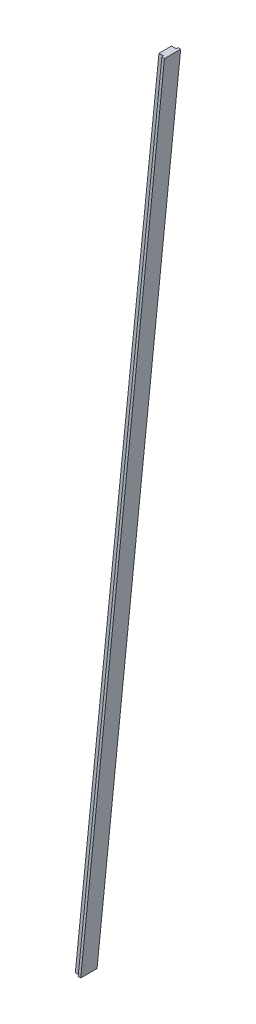
ISO-10303-21;
HEADER;
FILE_DESCRIPTION(('STEP AP214'),'2;1');
FILE_NAME('part.step','',(''),(''),'','','');
FILE_SCHEMA(('AUTOMOTIVE_DESIGN { 1 0 10303 214 1 1 1 1 }'));
ENDSEC;
DATA;
#1=APPLICATION_CONTEXT('core data for automotive mechanical design processes');
#2=APPLICATION_PROTOCOL_DEFINITION('international standard','automotive_design',2000,#1);
#3=PRODUCT_CONTEXT('',#1,'mechanical');
#4=PRODUCT('Part','Part','',(#3));
#5=PRODUCT_RELATED_PRODUCT_CATEGORY('part','',(#4));
#6=PRODUCT_DEFINITION_FORMATION('','',#4);
#7=PRODUCT_DEFINITION_CONTEXT('part definition',#1,'design');
#8=PRODUCT_DEFINITION('design','',#6,#7);
#9=PRODUCT_DEFINITION_SHAPE('','',#8);
#10=(LENGTH_UNIT() NAMED_UNIT(*) SI_UNIT(.MILLI.,.METRE.));
#11=(NAMED_UNIT(*) PLANE_ANGLE_UNIT() SI_UNIT($,.RADIAN.));
#12=(NAMED_UNIT(*) SI_UNIT($,.STERADIAN.) SOLID_ANGLE_UNIT());
#13=UNCERTAINTY_MEASURE_WITH_UNIT(LENGTH_MEASURE(1.E-05),#10,'distance_accuracy_value','');
#14=(GEOMETRIC_REPRESENTATION_CONTEXT(3) GLOBAL_UNCERTAINTY_ASSIGNED_CONTEXT((#13)) GLOBAL_UNIT_ASSIGNED_CONTEXT((#10,
#11,#12)) REPRESENTATION_CONTEXT('',''));
#15=CARTESIAN_POINT('',(0.,0.,0.));
#16=DIRECTION('',(0.,0.,1.));
#17=DIRECTION('',(1.,0.,0.));
#18=AXIS2_PLACEMENT_3D('',#15,#16,#17);
#19=CARTESIAN_POINT('',(101.565446023058,7.37466516204734,6.70567377190478));
#20=DIRECTION('',(-0.995055569961227,0.0993197497436294,0.));
#21=DIRECTION('',(0.,0.,-1.));
#22=AXIS2_PLACEMENT_3D('',#19,#20,#21);
#23=PLANE('',#22);
#24=DIRECTION('',(0.,0.,-1.));
#25=VECTOR('',#24,1.);
#26=CARTESIAN_POINT('',(100.923161092626,0.939799999999314,5.8928));
#27=LINE('',#26,#25);
#28=CARTESIAN_POINT('',(100.923161092622,0.939799999999659,5.5372));
#29=VERTEX_POINT('',#28);
#30=CARTESIAN_POINT('',(100.923161092622,0.93979999999966,6.2484));
#31=VERTEX_POINT('',#30);
#32=EDGE_CURVE('E124',#29,#31,#27,.F.);
#33=ORIENTED_EDGE('',*,*,#32,.F.);
#34=DIRECTION('',(0.0993197497436666,0.995055569961224,0.));
#35=VECTOR('',#34,1.);
#36=CARTESIAN_POINT('',(84.8570988929265,-160.021385669588,5.5372));
#37=LINE('',#36,#35);
#38=CARTESIAN_POINT('',(68.8089145710214,-320.803458102494,5.5372));
#39=VERTEX_POINT('',#38);
#40=EDGE_CURVE('E122',#29,#39,#37,.F.);
#41=ORIENTED_EDGE('',*,*,#40,.T.);
#42=DIRECTION('',(0.,0.,1.));
#43=VECTOR('',#42,1.);
#44=CARTESIAN_POINT('',(68.8089145710244,-320.803458102494,3.12420000000025));
#45=LINE('',#44,#43);
#46=CARTESIAN_POINT('',(68.8089145710244,-320.803458102494,6.2484));
#47=VERTEX_POINT('',#46);
#48=EDGE_CURVE('E75',#39,#47,#45,.T.);
#49=ORIENTED_EDGE('',*,*,#48,.T.);
#50=DIRECTION('',(-0.0993197497436633,-0.995055569961224,0.));
#51=VECTOR('',#50,1.);
#52=CARTESIAN_POINT('',(84.8709479532016,-159.882635979115,6.2484));
#53=LINE('',#52,#51);
#54=EDGE_CURVE('E74',#47,#31,#53,.F.);
#55=ORIENTED_EDGE('',*,*,#54,.T.);
#56=EDGE_LOOP('',(#33,#41,#49,#55));
#57=FACE_BOUND('',#56,.T.);
#58=ADVANCED_FACE('F17',(#57),#23,.T.);
#59=CARTESIAN_POINT('',(102.020816394357,7.3328311101911,5.5372));
#60=DIRECTION('',(0.,0.,1.));
#61=DIRECTION('',(-0.995055569961194,0.0993197497439631,0.));
#62=AXIS2_PLACEMENT_3D('',#59,#60,#61);
#63=PLANE('',#62);
#64=DIRECTION('',(-1.,0.,0.));
#65=VECTOR('',#64,1.);
#66=CARTESIAN_POINT('',(100.514741691463,0.9398,5.5372));
#67=LINE('',#66,#65);
#68=CARTESIAN_POINT('',(99.1108000000017,0.93979999999983,5.5372));
#69=VERTEX_POINT('',#68);
#70=EDGE_CURVE('E132',#29,#69,#67,.T.);
#71=ORIENTED_EDGE('',*,*,#70,.T.);
#72=DIRECTION('',(0.0993197497436294,0.995055569961227,0.));
#73=VECTOR('',#72,1.);
#74=CARTESIAN_POINT('',(83.0536767392028,-159.93182905122,5.5372));
#75=LINE('',#74,#73);
#76=CARTESIAN_POINT('',(66.9965534783867,-320.803458102495,5.5372));
#77=VERTEX_POINT('',#76);
#78=EDGE_CURVE('E115',#69,#77,#75,.F.);
#79=ORIENTED_EDGE('',*,*,#78,.T.);
#80=DIRECTION('',(1.,0.,0.));
#81=VECTOR('',#80,1.);
#82=CARTESIAN_POINT('',(68.4004951698689,-320.803458102494,5.5372));
#83=LINE('',#82,#81);
#84=EDGE_CURVE('E82',#77,#39,#83,.T.);
#85=ORIENTED_EDGE('',*,*,#84,.T.);
#86=ORIENTED_EDGE('',*,*,#40,.F.);
#87=EDGE_LOOP('',(#71,#79,#85,#86));
#88=FACE_BOUND('',#87,.T.);
#89=ADVANCED_FACE('F155',(#88),#63,.T.);
#90=CARTESIAN_POINT('',(99.753084930439,7.37466516204734,5.99447377190478));
#91=DIRECTION('',(-0.995055569961227,0.0993197497436295,0.));
#92=DIRECTION('',(0.,0.,-1.));
#93=AXIS2_PLACEMENT_3D('',#90,#91,#92);
#94=PLANE('',#93);
#95=DIRECTION('',(0.,0.,-1.));
#96=VECTOR('',#95,1.);
#97=CARTESIAN_POINT('',(99.1108,0.9398,3.12420000000025));
#98=LINE('',#97,#96);
#99=CARTESIAN_POINT('',(99.1108000000035,0.939799999999651,0.7112));
#100=VERTEX_POINT('',#99);
#101=EDGE_CURVE('E137',#69,#100,#98,.T.);
#102=ORIENTED_EDGE('',*,*,#101,.T.);
#103=DIRECTION('',(0.0993197497437047,0.99505556996122,0.));
#104=VECTOR('',#103,1.);
#105=CARTESIAN_POINT('',(83.0626156780673,-159.842272432836,0.7112));
#106=LINE('',#105,#104);
#107=CARTESIAN_POINT('',(66.9965534783834,-320.803458102494,0.7112));
#108=VERTEX_POINT('',#107);
#109=EDGE_CURVE('E112',#100,#108,#106,.F.);
#110=ORIENTED_EDGE('',*,*,#109,.T.);
#111=DIRECTION('',(0.,0.,1.));
#112=VECTOR('',#111,1.);
#113=CARTESIAN_POINT('',(66.9965534783802,-320.803458102494,3.12420000000025));
#114=LINE('',#113,#112);
#115=EDGE_CURVE('E142',#108,#77,#114,.T.);
#116=ORIENTED_EDGE('',*,*,#115,.T.);
#117=ORIENTED_EDGE('',*,*,#78,.F.);
#118=EDGE_LOOP('',(#102,#110,#116,#117));
#119=FACE_BOUND('',#118,.T.);
#120=ADVANCED_FACE('F162',(#119),#94,.T.);
#121=CARTESIAN_POINT('',(99.316307552027,7.60277698005952,0.7112));
#122=DIRECTION('',(0.,0.,-1.));
#123=DIRECTION('',(0.995055569961194,-0.0993197497439631,0.));
#124=AXIS2_PLACEMENT_3D('',#121,#122,#123);
#125=PLANE('',#124);
#126=DIRECTION('',(1.,0.,0.));
#127=VECTOR('',#126,1.);
#128=CARTESIAN_POINT('',(100.514741691463,0.9398,0.7112));
#129=LINE('',#128,#127);
#130=CARTESIAN_POINT('',(100.923161092621,0.939799999999828,0.7112));
#131=VERTEX_POINT('',#130);
#132=EDGE_CURVE('E87',#100,#131,#129,.T.);
#133=ORIENTED_EDGE('',*,*,#132,.T.);
#134=DIRECTION('',(0.0993197497436294,0.995055569961227,0.));
#135=VECTOR('',#134,1.);
#136=CARTESIAN_POINT('',(84.8660378318216,-159.93182905122,0.7112));
#137=LINE('',#136,#135);
#138=CARTESIAN_POINT('',(68.8089145710183,-320.803458102493,0.7112));
#139=VERTEX_POINT('',#138);
#140=EDGE_CURVE('E95',#131,#139,#137,.F.);
#141=ORIENTED_EDGE('',*,*,#140,.T.);
#142=DIRECTION('',(-1.,0.,0.));
#143=VECTOR('',#142,1.);
#144=CARTESIAN_POINT('',(68.4004951698689,-320.803458102494,0.7112));
#145=LINE('',#144,#143);
#146=EDGE_CURVE('E94',#139,#108,#145,.T.);
#147=ORIENTED_EDGE('',*,*,#146,.T.);
#148=ORIENTED_EDGE('',*,*,#109,.F.);
#149=EDGE_LOOP('',(#133,#141,#147,#148));
#150=FACE_BOUND('',#149,.T.);
#151=ADVANCED_FACE('F151',(#150),#125,.T.);
#152=CARTESIAN_POINT('',(101.565446023058,7.37466516204734,1.16847377190427));
#153=DIRECTION('',(-0.995055569961227,0.0993197497436294,0.));
#154=DIRECTION('',(0.,0.,-1.));
#155=AXIS2_PLACEMENT_3D('',#152,#153,#154);
#156=PLANE('',#155);
#157=DIRECTION('',(0.,0.,-1.));
#158=VECTOR('',#157,1.);
#159=CARTESIAN_POINT('',(100.923161092619,0.9398,3.12420000000025));
#160=LINE('',#159,#158);
#161=CARTESIAN_POINT('',(100.923161092619,0.939799999999991,0.));
#162=VERTEX_POINT('',#161);
#163=EDGE_CURVE('E85',#131,#162,#160,.T.);
#164=ORIENTED_EDGE('',*,*,#163,.T.);
#165=DIRECTION('',(0.0993197497436632,0.995055569961224,0.));
#166=VECTOR('',#165,1.);
#167=CARTESIAN_POINT('',(84.8709479531716,-159.882635979112,0.));
#168=LINE('',#167,#166);
#169=CARTESIAN_POINT('',(68.8089145710092,-320.803458102494,0.));
#170=VERTEX_POINT('',#169);
#171=EDGE_CURVE('E68',#162,#170,#168,.F.);
#172=ORIENTED_EDGE('',*,*,#171,.T.);
#173=DIRECTION('',(0.,0.,1.));
#174=VECTOR('',#173,1.);
#175=CARTESIAN_POINT('',(68.8089145710244,-320.803458102494,3.12420000000025));
#176=LINE('',#175,#174);
#177=EDGE_CURVE('E91',#170,#139,#176,.T.);
#178=ORIENTED_EDGE('',*,*,#177,.T.);
#179=ORIENTED_EDGE('',*,*,#140,.F.);
#180=EDGE_LOOP('',(#164,#172,#178,#179));
#181=FACE_BOUND('',#180,.T.);
#182=ADVANCED_FACE('F103',(#181),#156,.T.);
#183=CARTESIAN_POINT('',(66.5392797064932,-320.803458102494,6.70567377190478));
#184=DIRECTION('',(0.,1.,0.));
#185=DIRECTION('',(1.,0.,0.));
#186=AXIS2_PLACEMENT_3D('',#183,#184,#185);
#187=PLANE('',#186);
#188=DIRECTION('',(0.,0.,-1.));
#189=VECTOR('',#188,1.);
#190=CARTESIAN_POINT('',(69.80443686132,-320.803458102493,3.12420000000025));
#191=LINE('',#190,#189);
#192=CARTESIAN_POINT('',(69.80443686132,-320.803458102493,0.));
#193=VERTEX_POINT('',#192);
#194=CARTESIAN_POINT('',(69.80443686132,-320.803458102493,6.2484));
#195=VERTEX_POINT('',#194);
#196=EDGE_CURVE('E57',#193,#195,#191,.F.);
#197=ORIENTED_EDGE('',*,*,#196,.T.);
#198=DIRECTION('',(1.,0.,0.));
#199=VECTOR('',#198,1.);
#200=CARTESIAN_POINT('',(66.5392797064932,-320.803458102494,6.2484));
#201=LINE('',#200,#199);
#202=EDGE_CURVE('E21',#195,#47,#201,.F.);
#203=ORIENTED_EDGE('',*,*,#202,.T.);
#204=ORIENTED_EDGE('',*,*,#48,.F.);
#205=ORIENTED_EDGE('',*,*,#84,.F.);
#206=ORIENTED_EDGE('',*,*,#115,.F.);
#207=ORIENTED_EDGE('',*,*,#146,.F.);
#208=ORIENTED_EDGE('',*,*,#177,.F.);
#209=DIRECTION('',(1.,0.,0.));
#210=VECTOR('',#209,1.);
#211=CARTESIAN_POINT('',(66.5392797064932,-320.803458102494,0.));
#212=LINE('',#211,#210);
#213=EDGE_CURVE('E63',#170,#193,#212,.T.);
#214=ORIENTED_EDGE('',*,*,#213,.T.);
#215=EDGE_LOOP('',(#197,#203,#204,#205,#206,#207,#208,#214));
#216=FACE_BOUND('',#215,.T.);
#217=ADVANCED_FACE('F59',(#216),#187,.F.);
#218=CARTESIAN_POINT('',(103.016177531952,7.33121656834018,6.2484));
#219=DIRECTION('',(0.,0.,1.));
#220=DIRECTION('',(-0.995055569961153,0.0993197497443731,0.));
#221=AXIS2_PLACEMENT_3D('',#218,#219,#220);
#222=PLANE('',#221);
#223=DIRECTION('',(-1.,0.,0.));
#224=VECTOR('',#223,1.);
#225=CARTESIAN_POINT('',(100.514741691463,0.9398,6.2484));
#226=LINE('',#225,#224);
#227=CARTESIAN_POINT('',(101.918683382947,0.939800000000453,6.2484));
#228=VERTEX_POINT('',#227);
#229=EDGE_CURVE('E83',#228,#31,#226,.T.);
#230=ORIENTED_EDGE('',*,*,#229,.T.);
#231=ORIENTED_EDGE('',*,*,#54,.F.);
#232=ORIENTED_EDGE('',*,*,#202,.F.);
#233=DIRECTION('',(-0.0993197497436294,-0.995055569961227,0.));
#234=VECTOR('',#233,1.);
#235=CARTESIAN_POINT('',(85.8615601221294,-159.93182905122,6.2484));
#236=LINE('',#235,#234);
#237=EDGE_CURVE('E67',#195,#228,#236,.F.);
#238=ORIENTED_EDGE('',*,*,#237,.T.);
#239=EDGE_LOOP('',(#230,#231,#232,#238));
#240=FACE_BOUND('',#239,.T.);
#241=ADVANCED_FACE('F72',(#240),#222,.T.);
#242=CARTESIAN_POINT('',(102.375957154839,0.9398,6.70567377190478));
#243=DIRECTION('',(0.,-1.,0.));
#244=DIRECTION('',(-1.,0.,0.));
#245=AXIS2_PLACEMENT_3D('',#242,#243,#244);
#246=PLANE('',#245);
#247=DIRECTION('',(-1.,0.,0.));
#248=VECTOR('',#247,1.);
#249=CARTESIAN_POINT('',(102.375957154839,0.9398,0.));
#250=LINE('',#249,#248);
#251=CARTESIAN_POINT('',(101.918683382934,0.939800000000902,0.));
#252=VERTEX_POINT('',#251);
#253=EDGE_CURVE('E90',#252,#162,#250,.T.);
#254=ORIENTED_EDGE('',*,*,#253,.T.);
#255=ORIENTED_EDGE('',*,*,#163,.F.);
#256=ORIENTED_EDGE('',*,*,#132,.F.);
#257=ORIENTED_EDGE('',*,*,#101,.F.);
#258=ORIENTED_EDGE('',*,*,#70,.F.);
#259=ORIENTED_EDGE('',*,*,#32,.T.);
#260=ORIENTED_EDGE('',*,*,#229,.F.);
#261=DIRECTION('',(0.,0.,1.));
#262=VECTOR('',#261,1.);
#263=CARTESIAN_POINT('',(101.918683382934,0.939800000001824,3.12420000000025));
#264=LINE('',#263,#262);
#265=EDGE_CURVE('E27',#228,#252,#264,.F.);
#266=ORIENTED_EDGE('',*,*,#265,.T.);
#267=EDGE_LOOP('',(#254,#255,#256,#257,#258,#259,#260,#266));
#268=FACE_BOUND('',#267,.T.);
#269=ADVANCED_FACE('F98',(#268),#246,.F.);
#270=CARTESIAN_POINT('',(101.120449856892,7.52043534561688,0.));
#271=DIRECTION('',(0.,0.,-1.));
#272=DIRECTION('',(0.995055569961153,-0.0993197497443731,0.));
#273=AXIS2_PLACEMENT_3D('',#270,#271,#272);
#274=PLANE('',#273);
#275=ORIENTED_EDGE('',*,*,#253,.F.);
#276=DIRECTION('',(0.0993197497436294,0.995055569961227,0.));
#277=VECTOR('',#276,1.);
#278=CARTESIAN_POINT('',(85.8615601221294,-159.93182905122,0.));
#279=LINE('',#278,#277);
#280=EDGE_CURVE('E11',#252,#193,#279,.F.);
#281=ORIENTED_EDGE('',*,*,#280,.T.);
#282=ORIENTED_EDGE('',*,*,#213,.F.);
#283=ORIENTED_EDGE('',*,*,#171,.F.);
#284=EDGE_LOOP('',(#275,#281,#282,#283));
#285=FACE_BOUND('',#284,.T.);
#286=ADVANCED_FACE('F101',(#285),#274,.T.);
#287=CARTESIAN_POINT('',(102.560968313366,7.37466516204734,-0.457273771904272));
#288=DIRECTION('',(0.995055569961227,-0.0993197497436295,0.));
#289=DIRECTION('',(0.,0.,1.));
#290=AXIS2_PLACEMENT_3D('',#287,#288,#289);
#291=PLANE('',#290);
#292=ORIENTED_EDGE('',*,*,#265,.F.);
#293=ORIENTED_EDGE('',*,*,#237,.F.);
#294=ORIENTED_EDGE('',*,*,#196,.F.);
#295=ORIENTED_EDGE('',*,*,#280,.F.);
#296=EDGE_LOOP('',(#292,#293,#294,#295));
#297=FACE_BOUND('',#296,.T.);
#298=ADVANCED_FACE('F19',(#297),#291,.T.);
#299=CLOSED_SHELL('',(#58,#89,#120,#151,#182,#217,#241,#269,#286,#298));
#300=MANIFOLD_SOLID_BREP('B1',#299);
#301=ADVANCED_BREP_SHAPE_REPRESENTATION('',(#18,#300),#14);
#302=SHAPE_DEFINITION_REPRESENTATION(#9,#301);
ENDSEC;
END-ISO-10303-21;
